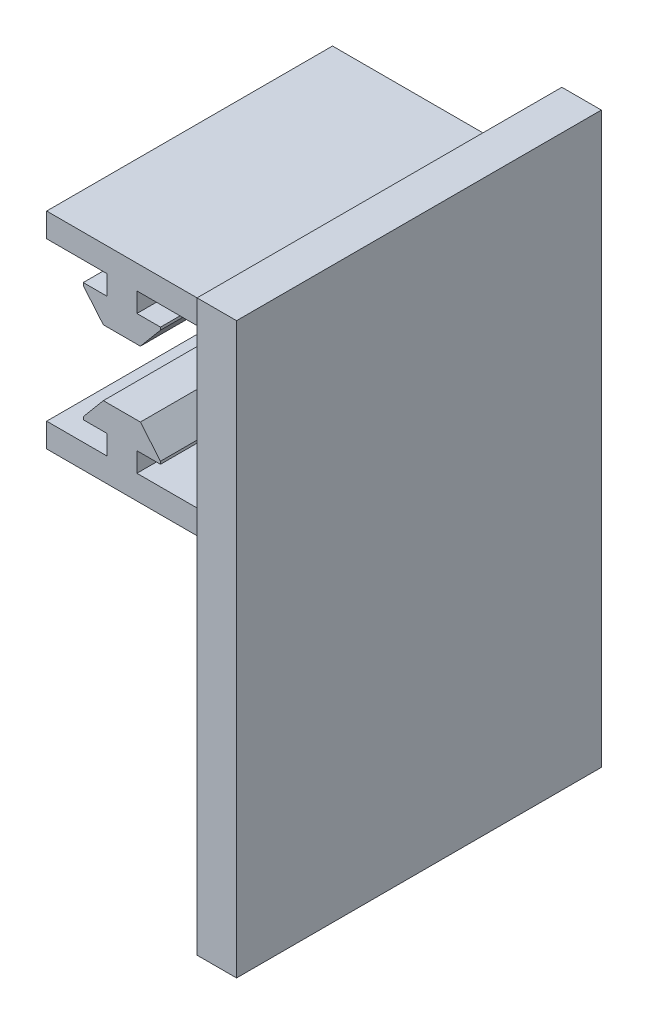
ISO-10303-21;
HEADER;
FILE_DESCRIPTION(('STEP AP214'),'2;1');
FILE_NAME('part.step','',(''),(''),'','','');
FILE_SCHEMA(('AUTOMOTIVE_DESIGN { 1 0 10303 214 1 1 1 1 }'));
ENDSEC;
DATA;
#1=APPLICATION_CONTEXT('core data for automotive mechanical design processes');
#2=APPLICATION_PROTOCOL_DEFINITION('international standard','automotive_design',2000,#1);
#3=PRODUCT_CONTEXT('',#1,'mechanical');
#4=PRODUCT('Part','Part','',(#3));
#5=PRODUCT_RELATED_PRODUCT_CATEGORY('part','',(#4));
#6=PRODUCT_DEFINITION_FORMATION('','',#4);
#7=PRODUCT_DEFINITION_CONTEXT('part definition',#1,'design');
#8=PRODUCT_DEFINITION('design','',#6,#7);
#9=PRODUCT_DEFINITION_SHAPE('','',#8);
#10=(LENGTH_UNIT() NAMED_UNIT(*) SI_UNIT(.MILLI.,.METRE.));
#11=(NAMED_UNIT(*) PLANE_ANGLE_UNIT() SI_UNIT($,.RADIAN.));
#12=(NAMED_UNIT(*) SI_UNIT($,.STERADIAN.) SOLID_ANGLE_UNIT());
#13=UNCERTAINTY_MEASURE_WITH_UNIT(LENGTH_MEASURE(1.E-05),#10,'distance_accuracy_value','');
#14=(GEOMETRIC_REPRESENTATION_CONTEXT(3) GLOBAL_UNCERTAINTY_ASSIGNED_CONTEXT((#13)) GLOBAL_UNIT_ASSIGNED_CONTEXT((#10,
#11,#12)) REPRESENTATION_CONTEXT('',''));
#15=CARTESIAN_POINT('',(0.,0.,0.));
#16=DIRECTION('',(0.,0.,1.));
#17=DIRECTION('',(1.,0.,0.));
#18=AXIS2_PLACEMENT_3D('',#15,#16,#17);
#19=CARTESIAN_POINT('',(-19.05,-43.302,457.2));
#20=DIRECTION('',(-1.,0.,0.));
#21=DIRECTION('',(0.,0.,1.));
#22=AXIS2_PLACEMENT_3D('',#19,#20,#21);
#23=PLANE('',#22);
#24=DIRECTION('',(0.,0.,-1.));
#25=VECTOR('',#24,1.);
#26=CARTESIAN_POINT('',(-19.05,-43.302,457.2));
#27=LINE('',#26,#25);
#28=CARTESIAN_POINT('',(-19.05,-43.302,415.2));
#29=VERTEX_POINT('',#28);
#30=CARTESIAN_POINT('',(-19.05,-43.302,342.8));
#31=VERTEX_POINT('',#30);
#32=EDGE_CURVE('E417',#29,#31,#27,.T.);
#33=ORIENTED_EDGE('',*,*,#32,.F.);
#34=DIRECTION('',(0.,-1.,0.));
#35=VECTOR('',#34,1.);
#36=CARTESIAN_POINT('',(-19.05,8.89,415.2));
#37=LINE('',#36,#35);
#38=CARTESIAN_POINT('',(-19.05,-37.206,415.2));
#39=VERTEX_POINT('',#38);
#40=EDGE_CURVE('E294',#39,#29,#37,.T.);
#41=ORIENTED_EDGE('',*,*,#40,.F.);
#42=DIRECTION('',(0.,0.,-1.));
#43=VECTOR('',#42,1.);
#44=CARTESIAN_POINT('',(-19.05,-37.206,457.2));
#45=LINE('',#44,#43);
#46=CARTESIAN_POINT('',(-19.05,-37.206,342.8));
#47=VERTEX_POINT('',#46);
#48=EDGE_CURVE('E395',#39,#47,#45,.T.);
#49=ORIENTED_EDGE('',*,*,#48,.T.);
#50=DIRECTION('',(0.,-1.,0.));
#51=VECTOR('',#50,1.);
#52=CARTESIAN_POINT('',(-19.05,-43.302,342.8));
#53=LINE('',#52,#51);
#54=EDGE_CURVE('E392',#47,#31,#53,.T.);
#55=ORIENTED_EDGE('',*,*,#54,.T.);
#56=EDGE_LOOP('',(#33,#41,#49,#55));
#57=FACE_BOUND('',#56,.T.);
#58=ADVANCED_FACE('F36',(#57),#23,.T.);
#59=CARTESIAN_POINT('',(-19.05,-43.302,457.2));
#60=DIRECTION('',(0.,-1.,0.));
#61=DIRECTION('',(0.,0.,-1.));
#62=AXIS2_PLACEMENT_3D('',#59,#60,#61);
#63=PLANE('',#62);
#64=DIRECTION('',(0.,0.,-1.));
#65=VECTOR('',#64,1.);
#66=CARTESIAN_POINT('',(29.05,-43.302,342.8));
#67=LINE('',#66,#65);
#68=CARTESIAN_POINT('',(29.05,-43.302,415.2));
#69=VERTEX_POINT('',#68);
#70=CARTESIAN_POINT('',(29.05,-43.302,342.8));
#71=VERTEX_POINT('',#70);
#72=EDGE_CURVE('E357',#69,#71,#67,.T.);
#73=ORIENTED_EDGE('',*,*,#72,.F.);
#74=DIRECTION('',(1.,0.,0.));
#75=VECTOR('',#74,1.);
#76=CARTESIAN_POINT('',(-19.05,-43.302,415.2));
#77=LINE('',#76,#75);
#78=EDGE_CURVE('E58',#29,#69,#77,.T.);
#79=ORIENTED_EDGE('',*,*,#78,.F.);
#80=ORIENTED_EDGE('',*,*,#32,.T.);
#81=DIRECTION('',(1.,0.,0.));
#82=VECTOR('',#81,1.);
#83=CARTESIAN_POINT('',(-19.05,-43.302,342.8));
#84=LINE('',#83,#82);
#85=EDGE_CURVE('E390',#31,#71,#84,.T.);
#86=ORIENTED_EDGE('',*,*,#85,.T.);
#87=EDGE_LOOP('',(#73,#79,#80,#86));
#88=FACE_BOUND('',#87,.T.);
#89=ADVANCED_FACE('F609',(#88),#63,.T.);
#90=CARTESIAN_POINT('',(19.05,-37.206,457.2));
#91=DIRECTION('',(0.,1.,0.));
#92=DIRECTION('',(0.,0.,1.));
#93=AXIS2_PLACEMENT_3D('',#90,#91,#92);
#94=PLANE('',#93);
#95=DIRECTION('',(0.,0.,-1.));
#96=VECTOR('',#95,1.);
#97=CARTESIAN_POINT('',(3.81,-37.206,457.2));
#98=LINE('',#97,#96);
#99=CARTESIAN_POINT('',(3.81,-37.206,415.2));
#100=VERTEX_POINT('',#99);
#101=CARTESIAN_POINT('',(3.81,-37.206,342.8));
#102=VERTEX_POINT('',#101);
#103=EDGE_CURVE('E415',#100,#102,#98,.T.);
#104=ORIENTED_EDGE('',*,*,#103,.F.);
#105=DIRECTION('',(1.,0.,0.));
#106=VECTOR('',#105,1.);
#107=CARTESIAN_POINT('',(19.05,-37.206,415.2));
#108=LINE('',#107,#106);
#109=CARTESIAN_POINT('',(19.95,-37.206,415.2));
#110=VERTEX_POINT('',#109);
#111=EDGE_CURVE('E325',#100,#110,#108,.T.);
#112=ORIENTED_EDGE('',*,*,#111,.T.);
#113=DIRECTION('',(0.,0.,-1.));
#114=VECTOR('',#113,1.);
#115=CARTESIAN_POINT('',(19.95,-37.206,432.8));
#116=LINE('',#115,#114);
#117=CARTESIAN_POINT('',(19.95,-37.206,342.8));
#118=VERTEX_POINT('',#117);
#119=EDGE_CURVE('E291',#110,#118,#116,.T.);
#120=ORIENTED_EDGE('',*,*,#119,.T.);
#121=DIRECTION('',(-1.,0.,0.));
#122=VECTOR('',#121,1.);
#123=CARTESIAN_POINT('',(19.05,-37.206,342.8));
#124=LINE('',#123,#122);
#125=EDGE_CURVE('E387',#118,#102,#124,.T.);
#126=ORIENTED_EDGE('',*,*,#125,.T.);
#127=EDGE_LOOP('',(#104,#112,#120,#126));
#128=FACE_BOUND('',#127,.T.);
#129=ADVANCED_FACE('F534',(#128),#94,.T.);
#130=CARTESIAN_POINT('',(3.81,-37.206,457.2));
#131=DIRECTION('',(1.,0.,0.));
#132=DIRECTION('',(0.,0.,-1.));
#133=AXIS2_PLACEMENT_3D('',#130,#131,#132);
#134=PLANE('',#133);
#135=DIRECTION('',(0.,0.,-1.));
#136=VECTOR('',#135,1.);
#137=CARTESIAN_POINT('',(3.81,-32.253,457.2));
#138=LINE('',#137,#136);
#139=CARTESIAN_POINT('',(3.81,-32.253,415.2));
#140=VERTEX_POINT('',#139);
#141=CARTESIAN_POINT('',(3.81,-32.253,342.8));
#142=VERTEX_POINT('',#141);
#143=EDGE_CURVE('E413',#140,#142,#138,.T.);
#144=ORIENTED_EDGE('',*,*,#143,.F.);
#145=DIRECTION('',(0.,-1.,0.));
#146=VECTOR('',#145,1.);
#147=CARTESIAN_POINT('',(3.81,-37.206,415.2));
#148=LINE('',#147,#146);
#149=EDGE_CURVE('E327',#140,#100,#148,.T.);
#150=ORIENTED_EDGE('',*,*,#149,.T.);
#151=ORIENTED_EDGE('',*,*,#103,.T.);
#152=DIRECTION('',(0.,1.,0.));
#153=VECTOR('',#152,1.);
#154=CARTESIAN_POINT('',(3.81,-37.206,342.8));
#155=LINE('',#154,#153);
#156=EDGE_CURVE('E384',#102,#142,#155,.T.);
#157=ORIENTED_EDGE('',*,*,#156,.T.);
#158=EDGE_LOOP('',(#144,#150,#151,#157));
#159=FACE_BOUND('',#158,.T.);
#160=ADVANCED_FACE('F531',(#159),#134,.T.);
#161=CARTESIAN_POINT('',(3.81,-32.253,457.2));
#162=DIRECTION('',(0.,-1.,0.));
#163=DIRECTION('',(1.,0.,0.));
#164=AXIS2_PLACEMENT_3D('',#161,#162,#163);
#165=PLANE('',#164);
#166=DIRECTION('',(0.,0.,-1.));
#167=VECTOR('',#166,1.);
#168=CARTESIAN_POINT('',(9.779,-32.253,457.2));
#169=LINE('',#168,#167);
#170=CARTESIAN_POINT('',(9.779,-32.253,415.2));
#171=VERTEX_POINT('',#170);
#172=CARTESIAN_POINT('',(9.779,-32.253,342.8));
#173=VERTEX_POINT('',#172);
#174=EDGE_CURVE('E411',#171,#173,#169,.T.);
#175=ORIENTED_EDGE('',*,*,#174,.F.);
#176=DIRECTION('',(-1.,0.,0.));
#177=VECTOR('',#176,1.);
#178=CARTESIAN_POINT('',(3.81,-32.253,415.2));
#179=LINE('',#178,#177);
#180=EDGE_CURVE('E330',#171,#140,#179,.T.);
#181=ORIENTED_EDGE('',*,*,#180,.T.);
#182=ORIENTED_EDGE('',*,*,#143,.T.);
#183=DIRECTION('',(1.,0.,0.));
#184=VECTOR('',#183,1.);
#185=CARTESIAN_POINT('',(3.81,-32.253,342.8));
#186=LINE('',#185,#184);
#187=EDGE_CURVE('E381',#142,#173,#186,.T.);
#188=ORIENTED_EDGE('',*,*,#187,.T.);
#189=EDGE_LOOP('',(#175,#181,#182,#188));
#190=FACE_BOUND('',#189,.T.);
#191=ADVANCED_FACE('F527',(#190),#165,.T.);
#192=CARTESIAN_POINT('',(9.779,-31.5799,457.2));
#193=DIRECTION('',(1.,0.,0.));
#194=DIRECTION('',(0.,0.,-1.));
#195=AXIS2_PLACEMENT_3D('',#192,#193,#194);
#196=PLANE('',#195);
#197=DIRECTION('',(0.,0.,-1.));
#198=VECTOR('',#197,1.);
#199=CARTESIAN_POINT('',(9.779,-31.5799,457.2));
#200=LINE('',#199,#198);
#201=CARTESIAN_POINT('',(9.779,-31.5799,415.2));
#202=VERTEX_POINT('',#201);
#203=CARTESIAN_POINT('',(9.779,-31.5799,342.8));
#204=VERTEX_POINT('',#203);
#205=EDGE_CURVE('E409',#202,#204,#200,.T.);
#206=ORIENTED_EDGE('',*,*,#205,.F.);
#207=DIRECTION('',(0.,-1.,0.));
#208=VECTOR('',#207,1.);
#209=CARTESIAN_POINT('',(9.779,-31.5799,415.2));
#210=LINE('',#209,#208);
#211=EDGE_CURVE('E333',#202,#171,#210,.T.);
#212=ORIENTED_EDGE('',*,*,#211,.T.);
#213=ORIENTED_EDGE('',*,*,#174,.T.);
#214=DIRECTION('',(0.,1.,0.));
#215=VECTOR('',#214,1.);
#216=CARTESIAN_POINT('',(9.779,-31.5799,342.8));
#217=LINE('',#216,#215);
#218=EDGE_CURVE('E378',#173,#204,#217,.T.);
#219=ORIENTED_EDGE('',*,*,#218,.T.);
#220=EDGE_LOOP('',(#206,#212,#213,#219));
#221=FACE_BOUND('',#220,.T.);
#222=ADVANCED_FACE('F524',(#221),#196,.T.);
#223=CARTESIAN_POINT('',(4.69581834429117,-25.522,457.2));
#224=DIRECTION('',(0.766044443118979,0.642787609686538,0.));
#225=DIRECTION('',(-0.642787609686538,0.766044443118979,0.));
#226=AXIS2_PLACEMENT_3D('',#223,#224,#225);
#227=PLANE('',#226);
#228=DIRECTION('',(0.,0.,-1.));
#229=VECTOR('',#228,1.);
#230=CARTESIAN_POINT('',(4.69581834429117,-25.522,457.2));
#231=LINE('',#230,#229);
#232=CARTESIAN_POINT('',(4.69581834429117,-25.522,415.2));
#233=VERTEX_POINT('',#232);
#234=CARTESIAN_POINT('',(4.69581834429117,-25.522,342.8));
#235=VERTEX_POINT('',#234);
#236=EDGE_CURVE('E407',#233,#235,#231,.T.);
#237=ORIENTED_EDGE('',*,*,#236,.F.);
#238=DIRECTION('',(0.642787609686538,-0.766044443118979,0.));
#239=VECTOR('',#238,1.);
#240=CARTESIAN_POINT('',(4.69581834429117,-25.522,415.2));
#241=LINE('',#240,#239);
#242=EDGE_CURVE('E336',#233,#202,#241,.T.);
#243=ORIENTED_EDGE('',*,*,#242,.T.);
#244=ORIENTED_EDGE('',*,*,#205,.T.);
#245=DIRECTION('',(-0.642787609686538,0.766044443118979,0.));
#246=VECTOR('',#245,1.);
#247=CARTESIAN_POINT('',(4.69581834429117,-25.522,342.8));
#248=LINE('',#247,#246);
#249=EDGE_CURVE('E375',#204,#235,#248,.T.);
#250=ORIENTED_EDGE('',*,*,#249,.T.);
#251=EDGE_LOOP('',(#237,#243,#244,#250));
#252=FACE_BOUND('',#251,.T.);
#253=ADVANCED_FACE('F519',(#252),#227,.T.);
#254=CARTESIAN_POINT('',(-4.69581834429117,-25.522,457.2));
#255=DIRECTION('',(0.,1.,0.));
#256=DIRECTION('',(0.,0.,1.));
#257=AXIS2_PLACEMENT_3D('',#254,#255,#256);
#258=PLANE('',#257);
#259=DIRECTION('',(0.,0.,-1.));
#260=VECTOR('',#259,1.);
#261=CARTESIAN_POINT('',(-4.69581834429117,-25.522,457.2));
#262=LINE('',#261,#260);
#263=CARTESIAN_POINT('',(-4.69581834429117,-25.522,415.2));
#264=VERTEX_POINT('',#263);
#265=CARTESIAN_POINT('',(-4.69581834429117,-25.522,342.8));
#266=VERTEX_POINT('',#265);
#267=EDGE_CURVE('E405',#264,#266,#262,.T.);
#268=ORIENTED_EDGE('',*,*,#267,.F.);
#269=DIRECTION('',(1.,0.,0.));
#270=VECTOR('',#269,1.);
#271=CARTESIAN_POINT('',(-4.69581834429117,-25.522,415.2));
#272=LINE('',#271,#270);
#273=EDGE_CURVE('E339',#264,#233,#272,.T.);
#274=ORIENTED_EDGE('',*,*,#273,.T.);
#275=ORIENTED_EDGE('',*,*,#236,.T.);
#276=DIRECTION('',(-1.,0.,0.));
#277=VECTOR('',#276,1.);
#278=CARTESIAN_POINT('',(-4.69581834429117,-25.522,342.8));
#279=LINE('',#278,#277);
#280=EDGE_CURVE('E372',#235,#266,#279,.T.);
#281=ORIENTED_EDGE('',*,*,#280,.T.);
#282=EDGE_LOOP('',(#268,#274,#275,#281));
#283=FACE_BOUND('',#282,.T.);
#284=ADVANCED_FACE('F516',(#283),#258,.T.);
#285=CARTESIAN_POINT('',(-9.779,-31.5799,457.2));
#286=DIRECTION('',(-0.766044443118979,0.642787609686538,0.));
#287=DIRECTION('',(-0.642787609686538,-0.766044443118979,0.));
#288=AXIS2_PLACEMENT_3D('',#285,#286,#287);
#289=PLANE('',#288);
#290=DIRECTION('',(0.,0.,-1.));
#291=VECTOR('',#290,1.);
#292=CARTESIAN_POINT('',(-9.779,-31.5799,457.2));
#293=LINE('',#292,#291);
#294=CARTESIAN_POINT('',(-9.779,-31.5799,415.2));
#295=VERTEX_POINT('',#294);
#296=CARTESIAN_POINT('',(-9.779,-31.5799,342.8));
#297=VERTEX_POINT('',#296);
#298=EDGE_CURVE('E403',#295,#297,#293,.T.);
#299=ORIENTED_EDGE('',*,*,#298,.F.);
#300=DIRECTION('',(0.642787609686538,0.766044443118979,0.));
#301=VECTOR('',#300,1.);
#302=CARTESIAN_POINT('',(-9.779,-31.5799,415.2));
#303=LINE('',#302,#301);
#304=EDGE_CURVE('E342',#295,#264,#303,.T.);
#305=ORIENTED_EDGE('',*,*,#304,.T.);
#306=ORIENTED_EDGE('',*,*,#267,.T.);
#307=DIRECTION('',(-0.642787609686538,-0.766044443118979,0.));
#308=VECTOR('',#307,1.);
#309=CARTESIAN_POINT('',(-9.779,-31.5799,342.8));
#310=LINE('',#309,#308);
#311=EDGE_CURVE('E369',#266,#297,#310,.T.);
#312=ORIENTED_EDGE('',*,*,#311,.T.);
#313=EDGE_LOOP('',(#299,#305,#306,#312));
#314=FACE_BOUND('',#313,.T.);
#315=ADVANCED_FACE('F511',(#314),#289,.T.);
#316=CARTESIAN_POINT('',(-9.779,-32.253,457.2));
#317=DIRECTION('',(-1.,0.,0.));
#318=DIRECTION('',(0.,0.,1.));
#319=AXIS2_PLACEMENT_3D('',#316,#317,#318);
#320=PLANE('',#319);
#321=DIRECTION('',(0.,0.,-1.));
#322=VECTOR('',#321,1.);
#323=CARTESIAN_POINT('',(-9.779,-32.253,457.2));
#324=LINE('',#323,#322);
#325=CARTESIAN_POINT('',(-9.779,-32.253,415.2));
#326=VERTEX_POINT('',#325);
#327=CARTESIAN_POINT('',(-9.779,-32.253,342.8));
#328=VERTEX_POINT('',#327);
#329=EDGE_CURVE('E401',#326,#328,#324,.T.);
#330=ORIENTED_EDGE('',*,*,#329,.F.);
#331=DIRECTION('',(0.,1.,0.));
#332=VECTOR('',#331,1.);
#333=CARTESIAN_POINT('',(-9.779,-32.253,415.2));
#334=LINE('',#333,#332);
#335=EDGE_CURVE('E345',#326,#295,#334,.T.);
#336=ORIENTED_EDGE('',*,*,#335,.T.);
#337=ORIENTED_EDGE('',*,*,#298,.T.);
#338=DIRECTION('',(0.,-1.,0.));
#339=VECTOR('',#338,1.);
#340=CARTESIAN_POINT('',(-9.779,-32.253,342.8));
#341=LINE('',#340,#339);
#342=EDGE_CURVE('E366',#297,#328,#341,.T.);
#343=ORIENTED_EDGE('',*,*,#342,.T.);
#344=EDGE_LOOP('',(#330,#336,#337,#343));
#345=FACE_BOUND('',#344,.T.);
#346=ADVANCED_FACE('F508',(#345),#320,.T.);
#347=CARTESIAN_POINT('',(-3.81,-32.253,457.2));
#348=DIRECTION('',(0.,-1.,0.));
#349=DIRECTION('',(1.,0.,0.));
#350=AXIS2_PLACEMENT_3D('',#347,#348,#349);
#351=PLANE('',#350);
#352=DIRECTION('',(0.,0.,-1.));
#353=VECTOR('',#352,1.);
#354=CARTESIAN_POINT('',(-3.81,-32.253,457.2));
#355=LINE('',#354,#353);
#356=CARTESIAN_POINT('',(-3.81,-32.253,415.2));
#357=VERTEX_POINT('',#356);
#358=CARTESIAN_POINT('',(-3.81,-32.253,342.8));
#359=VERTEX_POINT('',#358);
#360=EDGE_CURVE('E399',#357,#359,#355,.T.);
#361=ORIENTED_EDGE('',*,*,#360,.F.);
#362=DIRECTION('',(-1.,0.,0.));
#363=VECTOR('',#362,1.);
#364=CARTESIAN_POINT('',(-3.81,-32.253,415.2));
#365=LINE('',#364,#363);
#366=EDGE_CURVE('E348',#357,#326,#365,.T.);
#367=ORIENTED_EDGE('',*,*,#366,.T.);
#368=ORIENTED_EDGE('',*,*,#329,.T.);
#369=DIRECTION('',(1.,0.,0.));
#370=VECTOR('',#369,1.);
#371=CARTESIAN_POINT('',(-3.81,-32.253,342.8));
#372=LINE('',#371,#370);
#373=EDGE_CURVE('E363',#328,#359,#372,.T.);
#374=ORIENTED_EDGE('',*,*,#373,.T.);
#375=EDGE_LOOP('',(#361,#367,#368,#374));
#376=FACE_BOUND('',#375,.T.);
#377=ADVANCED_FACE('F503',(#376),#351,.T.);
#378=CARTESIAN_POINT('',(-3.81,-37.206,457.2));
#379=DIRECTION('',(-1.,0.,0.));
#380=DIRECTION('',(0.,0.,1.));
#381=AXIS2_PLACEMENT_3D('',#378,#379,#380);
#382=PLANE('',#381);
#383=DIRECTION('',(0.,0.,-1.));
#384=VECTOR('',#383,1.);
#385=CARTESIAN_POINT('',(-3.81,-37.206,457.2));
#386=LINE('',#385,#384);
#387=CARTESIAN_POINT('',(-3.81,-37.206,415.2));
#388=VERTEX_POINT('',#387);
#389=CARTESIAN_POINT('',(-3.81,-37.206,342.8));
#390=VERTEX_POINT('',#389);
#391=EDGE_CURVE('E397',#388,#390,#386,.T.);
#392=ORIENTED_EDGE('',*,*,#391,.F.);
#393=DIRECTION('',(0.,1.,0.));
#394=VECTOR('',#393,1.);
#395=CARTESIAN_POINT('',(-3.81,-37.206,415.2));
#396=LINE('',#395,#394);
#397=EDGE_CURVE('E351',#388,#357,#396,.T.);
#398=ORIENTED_EDGE('',*,*,#397,.T.);
#399=ORIENTED_EDGE('',*,*,#360,.T.);
#400=DIRECTION('',(0.,-1.,0.));
#401=VECTOR('',#400,1.);
#402=CARTESIAN_POINT('',(-3.81,-37.206,342.8));
#403=LINE('',#402,#401);
#404=EDGE_CURVE('E360',#359,#390,#403,.T.);
#405=ORIENTED_EDGE('',*,*,#404,.T.);
#406=EDGE_LOOP('',(#392,#398,#399,#405));
#407=FACE_BOUND('',#406,.T.);
#408=ADVANCED_FACE('F500',(#407),#382,.T.);
#409=CARTESIAN_POINT('',(-19.05,-37.206,457.2));
#410=DIRECTION('',(0.,1.,0.));
#411=DIRECTION('',(0.,0.,1.));
#412=AXIS2_PLACEMENT_3D('',#409,#410,#411);
#413=PLANE('',#412);
#414=ORIENTED_EDGE('',*,*,#48,.F.);
#415=DIRECTION('',(1.,0.,0.));
#416=VECTOR('',#415,1.);
#417=CARTESIAN_POINT('',(-19.05,-37.206,415.2));
#418=LINE('',#417,#416);
#419=EDGE_CURVE('E354',#39,#388,#418,.T.);
#420=ORIENTED_EDGE('',*,*,#419,.T.);
#421=ORIENTED_EDGE('',*,*,#391,.T.);
#422=DIRECTION('',(-1.,0.,0.));
#423=VECTOR('',#422,1.);
#424=CARTESIAN_POINT('',(-19.05,-37.206,342.8));
#425=LINE('',#424,#423);
#426=EDGE_CURVE('E44',#390,#47,#425,.T.);
#427=ORIENTED_EDGE('',*,*,#426,.T.);
#428=EDGE_LOOP('',(#414,#420,#421,#427));
#429=FACE_BOUND('',#428,.T.);
#430=ADVANCED_FACE('F491',(#429),#413,.T.);
#431=CARTESIAN_POINT('',(-19.05,8.89,457.2));
#432=DIRECTION('',(1.,0.,0.));
#433=DIRECTION('',(0.,0.,-1.));
#434=AXIS2_PLACEMENT_3D('',#431,#432,#433);
#435=PLANE('',#434);
#436=CARTESIAN_POINT('',(-19.05,8.89,415.2));
#437=VERTEX_POINT('',#436);
#438=CARTESIAN_POINT('',(-19.05,2.794,415.2));
#439=VERTEX_POINT('',#438);
#440=EDGE_CURVE('E297',#437,#439,#37,.T.);
#441=ORIENTED_EDGE('',*,*,#440,.F.);
#442=DIRECTION('',(0.,0.,-1.));
#443=VECTOR('',#442,1.);
#444=CARTESIAN_POINT('',(-19.05,8.89,457.2));
#445=LINE('',#444,#443);
#446=CARTESIAN_POINT('',(-19.05,8.89,342.8));
#447=VERTEX_POINT('',#446);
#448=EDGE_CURVE('E461',#437,#447,#445,.T.);
#449=ORIENTED_EDGE('',*,*,#448,.T.);
#450=DIRECTION('',(0.,1.,0.));
#451=VECTOR('',#450,1.);
#452=CARTESIAN_POINT('',(-19.05,8.89,342.8));
#453=LINE('',#452,#451);
#454=CARTESIAN_POINT('',(-19.05,2.794,342.8));
#455=VERTEX_POINT('',#454);
#456=EDGE_CURVE('E458',#455,#447,#453,.T.);
#457=ORIENTED_EDGE('',*,*,#456,.F.);
#458=DIRECTION('',(0.,0.,-1.));
#459=VECTOR('',#458,1.);
#460=CARTESIAN_POINT('',(-19.05,2.794,457.2));
#461=LINE('',#460,#459);
#462=EDGE_CURVE('E483',#439,#455,#461,.T.);
#463=ORIENTED_EDGE('',*,*,#462,.F.);
#464=EDGE_LOOP('',(#441,#449,#457,#463));
#465=FACE_BOUND('',#464,.T.);
#466=ADVANCED_FACE('F38',(#465),#435,.F.);
#467=CARTESIAN_POINT('',(-19.05,2.794,457.2));
#468=DIRECTION('',(0.,1.,0.));
#469=DIRECTION('',(0.,0.,1.));
#470=AXIS2_PLACEMENT_3D('',#467,#468,#469);
#471=PLANE('',#470);
#472=DIRECTION('',(1.,0.,0.));
#473=VECTOR('',#472,1.);
#474=CARTESIAN_POINT('',(-19.05,2.794,415.2));
#475=LINE('',#474,#473);
#476=CARTESIAN_POINT('',(-3.81,2.794,415.2));
#477=VERTEX_POINT('',#476);
#478=EDGE_CURVE('E323',#439,#477,#475,.T.);
#479=ORIENTED_EDGE('',*,*,#478,.F.);
#480=ORIENTED_EDGE('',*,*,#462,.T.);
#481=DIRECTION('',(-1.,0.,0.));
#482=VECTOR('',#481,1.);
#483=CARTESIAN_POINT('',(-19.05,2.794,342.8));
#484=LINE('',#483,#482);
#485=CARTESIAN_POINT('',(-3.81,2.794,342.8));
#486=VERTEX_POINT('',#485);
#487=EDGE_CURVE('E455',#486,#455,#484,.T.);
#488=ORIENTED_EDGE('',*,*,#487,.F.);
#489=DIRECTION('',(0.,0.,-1.));
#490=VECTOR('',#489,1.);
#491=CARTESIAN_POINT('',(-3.81,2.794,457.2));
#492=LINE('',#491,#490);
#493=EDGE_CURVE('E481',#477,#486,#492,.T.);
#494=ORIENTED_EDGE('',*,*,#493,.F.);
#495=EDGE_LOOP('',(#479,#480,#488,#494));
#496=FACE_BOUND('',#495,.T.);
#497=ADVANCED_FACE('F591',(#496),#471,.F.);
#498=CARTESIAN_POINT('',(-3.81,2.794,457.2));
#499=DIRECTION('',(1.,0.,0.));
#500=DIRECTION('',(0.,0.,-1.));
#501=AXIS2_PLACEMENT_3D('',#498,#499,#500);
#502=PLANE('',#501);
#503=DIRECTION('',(0.,-1.,0.));
#504=VECTOR('',#503,1.);
#505=CARTESIAN_POINT('',(-3.81,2.794,415.2));
#506=LINE('',#505,#504);
#507=CARTESIAN_POINT('',(-3.81,-2.159,415.2));
#508=VERTEX_POINT('',#507);
#509=EDGE_CURVE('E321',#477,#508,#506,.T.);
#510=ORIENTED_EDGE('',*,*,#509,.F.);
#511=ORIENTED_EDGE('',*,*,#493,.T.);
#512=DIRECTION('',(0.,1.,0.));
#513=VECTOR('',#512,1.);
#514=CARTESIAN_POINT('',(-3.81,2.794,342.8));
#515=LINE('',#514,#513);
#516=CARTESIAN_POINT('',(-3.81,-2.159,342.8));
#517=VERTEX_POINT('',#516);
#518=EDGE_CURVE('E452',#517,#486,#515,.T.);
#519=ORIENTED_EDGE('',*,*,#518,.F.);
#520=DIRECTION('',(0.,0.,-1.));
#521=VECTOR('',#520,1.);
#522=CARTESIAN_POINT('',(-3.81,-2.159,457.2));
#523=LINE('',#522,#521);
#524=EDGE_CURVE('E479',#508,#517,#523,.T.);
#525=ORIENTED_EDGE('',*,*,#524,.F.);
#526=EDGE_LOOP('',(#510,#511,#519,#525));
#527=FACE_BOUND('',#526,.T.);
#528=ADVANCED_FACE('F585',(#527),#502,.F.);
#529=CARTESIAN_POINT('',(-3.81,-2.159,457.2));
#530=DIRECTION('',(0.,-1.,0.));
#531=DIRECTION('',(1.,0.,0.));
#532=AXIS2_PLACEMENT_3D('',#529,#530,#531);
#533=PLANE('',#532);
#534=DIRECTION('',(-1.,0.,0.));
#535=VECTOR('',#534,1.);
#536=CARTESIAN_POINT('',(-3.81,-2.159,415.2));
#537=LINE('',#536,#535);
#538=CARTESIAN_POINT('',(-9.779,-2.159,415.2));
#539=VERTEX_POINT('',#538);
#540=EDGE_CURVE('E319',#508,#539,#537,.T.);
#541=ORIENTED_EDGE('',*,*,#540,.F.);
#542=ORIENTED_EDGE('',*,*,#524,.T.);
#543=DIRECTION('',(1.,0.,0.));
#544=VECTOR('',#543,1.);
#545=CARTESIAN_POINT('',(-3.81,-2.159,342.8));
#546=LINE('',#545,#544);
#547=CARTESIAN_POINT('',(-9.779,-2.159,342.8));
#548=VERTEX_POINT('',#547);
#549=EDGE_CURVE('E449',#548,#517,#546,.T.);
#550=ORIENTED_EDGE('',*,*,#549,.F.);
#551=DIRECTION('',(0.,0.,-1.));
#552=VECTOR('',#551,1.);
#553=CARTESIAN_POINT('',(-9.779,-2.159,457.2));
#554=LINE('',#553,#552);
#555=EDGE_CURVE('E477',#539,#548,#554,.T.);
#556=ORIENTED_EDGE('',*,*,#555,.F.);
#557=EDGE_LOOP('',(#541,#542,#550,#556));
#558=FACE_BOUND('',#557,.T.);
#559=ADVANCED_FACE('F581',(#558),#533,.F.);
#560=CARTESIAN_POINT('',(-9.779,-2.159,457.2));
#561=DIRECTION('',(1.,0.,0.));
#562=DIRECTION('',(0.,0.,-1.));
#563=AXIS2_PLACEMENT_3D('',#560,#561,#562);
#564=PLANE('',#563);
#565=DIRECTION('',(0.,-1.,0.));
#566=VECTOR('',#565,1.);
#567=CARTESIAN_POINT('',(-9.779,-2.159,415.2));
#568=LINE('',#567,#566);
#569=CARTESIAN_POINT('',(-9.779,-2.8321,415.2));
#570=VERTEX_POINT('',#569);
#571=EDGE_CURVE('E317',#539,#570,#568,.T.);
#572=ORIENTED_EDGE('',*,*,#571,.F.);
#573=ORIENTED_EDGE('',*,*,#555,.T.);
#574=DIRECTION('',(0.,1.,0.));
#575=VECTOR('',#574,1.);
#576=CARTESIAN_POINT('',(-9.779,-2.159,342.8));
#577=LINE('',#576,#575);
#578=CARTESIAN_POINT('',(-9.779,-2.8321,342.8));
#579=VERTEX_POINT('',#578);
#580=EDGE_CURVE('E446',#579,#548,#577,.T.);
#581=ORIENTED_EDGE('',*,*,#580,.F.);
#582=DIRECTION('',(0.,0.,-1.));
#583=VECTOR('',#582,1.);
#584=CARTESIAN_POINT('',(-9.779,-2.8321,457.2));
#585=LINE('',#584,#583);
#586=EDGE_CURVE('E475',#570,#579,#585,.T.);
#587=ORIENTED_EDGE('',*,*,#586,.F.);
#588=EDGE_LOOP('',(#572,#573,#581,#587));
#589=FACE_BOUND('',#588,.T.);
#590=ADVANCED_FACE('F575',(#589),#564,.F.);
#591=CARTESIAN_POINT('',(-9.779,-2.8321,457.2));
#592=DIRECTION('',(0.766044443118979,0.642787609686538,0.));
#593=DIRECTION('',(-0.642787609686538,0.766044443118979,0.));
#594=AXIS2_PLACEMENT_3D('',#591,#592,#593);
#595=PLANE('',#594);
#596=DIRECTION('',(0.642787609686538,-0.766044443118979,0.));
#597=VECTOR('',#596,1.);
#598=CARTESIAN_POINT('',(-9.779,-2.8321,415.2));
#599=LINE('',#598,#597);
#600=CARTESIAN_POINT('',(-4.69581834429117,-8.89,415.2));
#601=VERTEX_POINT('',#600);
#602=EDGE_CURVE('E315',#570,#601,#599,.T.);
#603=ORIENTED_EDGE('',*,*,#602,.F.);
#604=ORIENTED_EDGE('',*,*,#586,.T.);
#605=DIRECTION('',(-0.642787609686538,0.766044443118979,0.));
#606=VECTOR('',#605,1.);
#607=CARTESIAN_POINT('',(-9.779,-2.8321,342.8));
#608=LINE('',#607,#606);
#609=CARTESIAN_POINT('',(-4.69581834429117,-8.89,342.8));
#610=VERTEX_POINT('',#609);
#611=EDGE_CURVE('E443',#610,#579,#608,.T.);
#612=ORIENTED_EDGE('',*,*,#611,.F.);
#613=DIRECTION('',(0.,0.,-1.));
#614=VECTOR('',#613,1.);
#615=CARTESIAN_POINT('',(-4.69581834429117,-8.89,457.2));
#616=LINE('',#615,#614);
#617=EDGE_CURVE('E473',#601,#610,#616,.T.);
#618=ORIENTED_EDGE('',*,*,#617,.F.);
#619=EDGE_LOOP('',(#603,#604,#612,#618));
#620=FACE_BOUND('',#619,.T.);
#621=ADVANCED_FACE('F571',(#620),#595,.F.);
#622=CARTESIAN_POINT('',(-4.69581834429117,-8.89,457.2));
#623=DIRECTION('',(0.,1.,0.));
#624=DIRECTION('',(0.,0.,1.));
#625=AXIS2_PLACEMENT_3D('',#622,#623,#624);
#626=PLANE('',#625);
#627=DIRECTION('',(1.,0.,0.));
#628=VECTOR('',#627,1.);
#629=CARTESIAN_POINT('',(-4.69581834429117,-8.89,415.2));
#630=LINE('',#629,#628);
#631=CARTESIAN_POINT('',(4.69581834429117,-8.89,415.2));
#632=VERTEX_POINT('',#631);
#633=EDGE_CURVE('E313',#601,#632,#630,.T.);
#634=ORIENTED_EDGE('',*,*,#633,.F.);
#635=ORIENTED_EDGE('',*,*,#617,.T.);
#636=DIRECTION('',(-1.,0.,0.));
#637=VECTOR('',#636,1.);
#638=CARTESIAN_POINT('',(-4.69581834429117,-8.89,342.8));
#639=LINE('',#638,#637);
#640=CARTESIAN_POINT('',(4.69581834429117,-8.89,342.8));
#641=VERTEX_POINT('',#640);
#642=EDGE_CURVE('E440',#641,#610,#639,.T.);
#643=ORIENTED_EDGE('',*,*,#642,.F.);
#644=DIRECTION('',(0.,0.,-1.));
#645=VECTOR('',#644,1.);
#646=CARTESIAN_POINT('',(4.69581834429117,-8.89,457.2));
#647=LINE('',#646,#645);
#648=EDGE_CURVE('E471',#632,#641,#647,.T.);
#649=ORIENTED_EDGE('',*,*,#648,.F.);
#650=EDGE_LOOP('',(#634,#635,#643,#649));
#651=FACE_BOUND('',#650,.T.);
#652=ADVANCED_FACE('F565',(#651),#626,.F.);
#653=CARTESIAN_POINT('',(4.69581834429117,-8.89,457.2));
#654=DIRECTION('',(-0.766044443118979,0.642787609686538,0.));
#655=DIRECTION('',(-0.642787609686538,-0.766044443118979,0.));
#656=AXIS2_PLACEMENT_3D('',#653,#654,#655);
#657=PLANE('',#656);
#658=DIRECTION('',(0.642787609686538,0.766044443118979,0.));
#659=VECTOR('',#658,1.);
#660=CARTESIAN_POINT('',(4.69581834429117,-8.89,415.2));
#661=LINE('',#660,#659);
#662=CARTESIAN_POINT('',(9.779,-2.8321,415.2));
#663=VERTEX_POINT('',#662);
#664=EDGE_CURVE('E311',#632,#663,#661,.T.);
#665=ORIENTED_EDGE('',*,*,#664,.F.);
#666=ORIENTED_EDGE('',*,*,#648,.T.);
#667=DIRECTION('',(-0.642787609686538,-0.766044443118979,0.));
#668=VECTOR('',#667,1.);
#669=CARTESIAN_POINT('',(4.69581834429117,-8.89,342.8));
#670=LINE('',#669,#668);
#671=CARTESIAN_POINT('',(9.779,-2.8321,342.8));
#672=VERTEX_POINT('',#671);
#673=EDGE_CURVE('E437',#672,#641,#670,.T.);
#674=ORIENTED_EDGE('',*,*,#673,.F.);
#675=DIRECTION('',(0.,0.,-1.));
#676=VECTOR('',#675,1.);
#677=CARTESIAN_POINT('',(9.779,-2.8321,457.2));
#678=LINE('',#677,#676);
#679=EDGE_CURVE('E469',#663,#672,#678,.T.);
#680=ORIENTED_EDGE('',*,*,#679,.F.);
#681=EDGE_LOOP('',(#665,#666,#674,#680));
#682=FACE_BOUND('',#681,.T.);
#683=ADVANCED_FACE('F561',(#682),#657,.F.);
#684=CARTESIAN_POINT('',(9.779,-2.8321,457.2));
#685=DIRECTION('',(-1.,0.,0.));
#686=DIRECTION('',(0.,0.,1.));
#687=AXIS2_PLACEMENT_3D('',#684,#685,#686);
#688=PLANE('',#687);
#689=DIRECTION('',(0.,1.,0.));
#690=VECTOR('',#689,1.);
#691=CARTESIAN_POINT('',(9.779,-2.8321,415.2));
#692=LINE('',#691,#690);
#693=CARTESIAN_POINT('',(9.779,-2.159,415.2));
#694=VERTEX_POINT('',#693);
#695=EDGE_CURVE('E309',#663,#694,#692,.T.);
#696=ORIENTED_EDGE('',*,*,#695,.F.);
#697=ORIENTED_EDGE('',*,*,#679,.T.);
#698=DIRECTION('',(0.,-1.,0.));
#699=VECTOR('',#698,1.);
#700=CARTESIAN_POINT('',(9.779,-2.8321,342.8));
#701=LINE('',#700,#699);
#702=CARTESIAN_POINT('',(9.779,-2.159,342.8));
#703=VERTEX_POINT('',#702);
#704=EDGE_CURVE('E434',#703,#672,#701,.T.);
#705=ORIENTED_EDGE('',*,*,#704,.F.);
#706=DIRECTION('',(0.,0.,-1.));
#707=VECTOR('',#706,1.);
#708=CARTESIAN_POINT('',(9.779,-2.159,457.2));
#709=LINE('',#708,#707);
#710=EDGE_CURVE('E467',#694,#703,#709,.T.);
#711=ORIENTED_EDGE('',*,*,#710,.F.);
#712=EDGE_LOOP('',(#696,#697,#705,#711));
#713=FACE_BOUND('',#712,.T.);
#714=ADVANCED_FACE('F555',(#713),#688,.F.);
#715=CARTESIAN_POINT('',(3.81,-2.159,457.2));
#716=DIRECTION('',(0.,-1.,0.));
#717=DIRECTION('',(1.,0.,0.));
#718=AXIS2_PLACEMENT_3D('',#715,#716,#717);
#719=PLANE('',#718);
#720=DIRECTION('',(-1.,0.,0.));
#721=VECTOR('',#720,1.);
#722=CARTESIAN_POINT('',(3.81,-2.159,415.2));
#723=LINE('',#722,#721);
#724=CARTESIAN_POINT('',(3.81,-2.159,415.2));
#725=VERTEX_POINT('',#724);
#726=EDGE_CURVE('E307',#694,#725,#723,.T.);
#727=ORIENTED_EDGE('',*,*,#726,.F.);
#728=ORIENTED_EDGE('',*,*,#710,.T.);
#729=DIRECTION('',(1.,0.,0.));
#730=VECTOR('',#729,1.);
#731=CARTESIAN_POINT('',(3.81,-2.159,342.8));
#732=LINE('',#731,#730);
#733=CARTESIAN_POINT('',(3.81,-2.159,342.8));
#734=VERTEX_POINT('',#733);
#735=EDGE_CURVE('E431',#734,#703,#732,.T.);
#736=ORIENTED_EDGE('',*,*,#735,.F.);
#737=DIRECTION('',(0.,0.,-1.));
#738=VECTOR('',#737,1.);
#739=CARTESIAN_POINT('',(3.81,-2.159,457.2));
#740=LINE('',#739,#738);
#741=EDGE_CURVE('E465',#725,#734,#740,.T.);
#742=ORIENTED_EDGE('',*,*,#741,.F.);
#743=EDGE_LOOP('',(#727,#728,#736,#742));
#744=FACE_BOUND('',#743,.T.);
#745=ADVANCED_FACE('F551',(#744),#719,.F.);
#746=CARTESIAN_POINT('',(3.81,2.794,457.2));
#747=DIRECTION('',(-1.,0.,0.));
#748=DIRECTION('',(0.,0.,1.));
#749=AXIS2_PLACEMENT_3D('',#746,#747,#748);
#750=PLANE('',#749);
#751=DIRECTION('',(0.,1.,0.));
#752=VECTOR('',#751,1.);
#753=CARTESIAN_POINT('',(3.81,2.794,415.2));
#754=LINE('',#753,#752);
#755=CARTESIAN_POINT('',(3.81,2.794,415.2));
#756=VERTEX_POINT('',#755);
#757=EDGE_CURVE('E305',#725,#756,#754,.T.);
#758=ORIENTED_EDGE('',*,*,#757,.F.);
#759=ORIENTED_EDGE('',*,*,#741,.T.);
#760=DIRECTION('',(0.,-1.,0.));
#761=VECTOR('',#760,1.);
#762=CARTESIAN_POINT('',(3.81,2.794,342.8));
#763=LINE('',#762,#761);
#764=CARTESIAN_POINT('',(3.81,2.794,342.8));
#765=VERTEX_POINT('',#764);
#766=EDGE_CURVE('E428',#765,#734,#763,.T.);
#767=ORIENTED_EDGE('',*,*,#766,.F.);
#768=DIRECTION('',(0.,0.,-1.));
#769=VECTOR('',#768,1.);
#770=CARTESIAN_POINT('',(3.81,2.794,457.2));
#771=LINE('',#770,#769);
#772=EDGE_CURVE('E463',#756,#765,#771,.T.);
#773=ORIENTED_EDGE('',*,*,#772,.F.);
#774=EDGE_LOOP('',(#758,#759,#767,#773));
#775=FACE_BOUND('',#774,.T.);
#776=ADVANCED_FACE('F545',(#775),#750,.F.);
#777=CARTESIAN_POINT('',(19.05,2.794,457.2));
#778=DIRECTION('',(0.,1.,0.));
#779=DIRECTION('',(0.,0.,1.));
#780=AXIS2_PLACEMENT_3D('',#777,#778,#779);
#781=PLANE('',#780);
#782=DIRECTION('',(1.,0.,0.));
#783=VECTOR('',#782,1.);
#784=CARTESIAN_POINT('',(19.05,2.794,415.2));
#785=LINE('',#784,#783);
#786=CARTESIAN_POINT('',(19.95,2.794,415.2));
#787=VERTEX_POINT('',#786);
#788=EDGE_CURVE('E51',#756,#787,#785,.T.);
#789=ORIENTED_EDGE('',*,*,#788,.F.);
#790=ORIENTED_EDGE('',*,*,#772,.T.);
#791=DIRECTION('',(-1.,0.,0.));
#792=VECTOR('',#791,1.);
#793=CARTESIAN_POINT('',(19.05,2.794,342.8));
#794=LINE('',#793,#792);
#795=CARTESIAN_POINT('',(19.95,2.794,342.8));
#796=VERTEX_POINT('',#795);
#797=EDGE_CURVE('E425',#796,#765,#794,.T.);
#798=ORIENTED_EDGE('',*,*,#797,.F.);
#799=DIRECTION('',(0.,0.,-1.));
#800=VECTOR('',#799,1.);
#801=CARTESIAN_POINT('',(19.95,2.794,432.8));
#802=LINE('',#801,#800);
#803=EDGE_CURVE('E290',#787,#796,#802,.T.);
#804=ORIENTED_EDGE('',*,*,#803,.F.);
#805=EDGE_LOOP('',(#789,#790,#798,#804));
#806=FACE_BOUND('',#805,.T.);
#807=ADVANCED_FACE('F541',(#806),#781,.F.);
#808=CARTESIAN_POINT('',(-19.05,8.89,457.2));
#809=DIRECTION('',(0.,-1.,0.));
#810=DIRECTION('',(0.,0.,-1.));
#811=AXIS2_PLACEMENT_3D('',#808,#809,#810);
#812=PLANE('',#811);
#813=DIRECTION('',(-1.,0.,0.));
#814=VECTOR('',#813,1.);
#815=CARTESIAN_POINT('',(-19.05,8.89,415.2));
#816=LINE('',#815,#814);
#817=CARTESIAN_POINT('',(29.05,8.89,415.2));
#818=VERTEX_POINT('',#817);
#819=EDGE_CURVE('E302',#818,#437,#816,.T.);
#820=ORIENTED_EDGE('',*,*,#819,.F.);
#821=DIRECTION('',(0.,0.,1.));
#822=VECTOR('',#821,1.);
#823=CARTESIAN_POINT('',(29.05,8.89,457.2));
#824=LINE('',#823,#822);
#825=CARTESIAN_POINT('',(29.05,8.89,342.8));
#826=VERTEX_POINT('',#825);
#827=EDGE_CURVE('E422',#826,#818,#824,.T.);
#828=ORIENTED_EDGE('',*,*,#827,.F.);
#829=DIRECTION('',(1.,0.,0.));
#830=VECTOR('',#829,1.);
#831=CARTESIAN_POINT('',(-19.05,8.89,342.8));
#832=LINE('',#831,#830);
#833=EDGE_CURVE('E485',#447,#826,#832,.T.);
#834=ORIENTED_EDGE('',*,*,#833,.F.);
#835=ORIENTED_EDGE('',*,*,#448,.F.);
#836=EDGE_LOOP('',(#820,#828,#834,#835));
#837=FACE_BOUND('',#836,.T.);
#838=ADVANCED_FACE('F600',(#837),#812,.F.);
#839=CARTESIAN_POINT('',(0.,0.,342.8));
#840=DIRECTION('',(0.,0.,-1.));
#841=DIRECTION('',(-1.,0.,0.));
#842=AXIS2_PLACEMENT_3D('',#839,#840,#841);
#843=PLANE('',#842);
#844=ORIENTED_EDGE('',*,*,#125,.F.);
#845=DIRECTION('',(0.,-1.,0.));
#846=VECTOR('',#845,1.);
#847=CARTESIAN_POINT('',(19.95,2.794,342.8));
#848=LINE('',#847,#846);
#849=EDGE_CURVE('E264',#796,#118,#848,.T.);
#850=ORIENTED_EDGE('',*,*,#849,.F.);
#851=ORIENTED_EDGE('',*,*,#797,.T.);
#852=ORIENTED_EDGE('',*,*,#766,.T.);
#853=ORIENTED_EDGE('',*,*,#735,.T.);
#854=ORIENTED_EDGE('',*,*,#704,.T.);
#855=ORIENTED_EDGE('',*,*,#673,.T.);
#856=ORIENTED_EDGE('',*,*,#642,.T.);
#857=ORIENTED_EDGE('',*,*,#611,.T.);
#858=ORIENTED_EDGE('',*,*,#580,.T.);
#859=ORIENTED_EDGE('',*,*,#549,.T.);
#860=ORIENTED_EDGE('',*,*,#518,.T.);
#861=ORIENTED_EDGE('',*,*,#487,.T.);
#862=ORIENTED_EDGE('',*,*,#456,.T.);
#863=ORIENTED_EDGE('',*,*,#833,.T.);
#864=DIRECTION('',(0.,1.,0.));
#865=VECTOR('',#864,1.);
#866=CARTESIAN_POINT('',(29.05,8.89,342.8));
#867=LINE('',#866,#865);
#868=EDGE_CURVE('E419',#71,#826,#867,.T.);
#869=ORIENTED_EDGE('',*,*,#868,.F.);
#870=ORIENTED_EDGE('',*,*,#85,.F.);
#871=ORIENTED_EDGE('',*,*,#54,.F.);
#872=ORIENTED_EDGE('',*,*,#426,.F.);
#873=ORIENTED_EDGE('',*,*,#404,.F.);
#874=ORIENTED_EDGE('',*,*,#373,.F.);
#875=ORIENTED_EDGE('',*,*,#342,.F.);
#876=ORIENTED_EDGE('',*,*,#311,.F.);
#877=ORIENTED_EDGE('',*,*,#280,.F.);
#878=ORIENTED_EDGE('',*,*,#249,.F.);
#879=ORIENTED_EDGE('',*,*,#218,.F.);
#880=ORIENTED_EDGE('',*,*,#187,.F.);
#881=ORIENTED_EDGE('',*,*,#156,.F.);
#882=EDGE_LOOP('',(#844,#850,#851,#852,#853,#854,#855,#856,#857,#858,#859,#860,#861,#862,#863,
#869,#870,#871,#872,#873,#874,#875,#876,#877,#878,#879,#880,#881));
#883=FACE_BOUND('',#882,.T.);
#884=ADVANCED_FACE('F496',(#883),#843,.T.);
#885=CARTESIAN_POINT('',(0.,0.,415.2));
#886=DIRECTION('',(0.,0.,1.));
#887=DIRECTION('',(1.,0.,0.));
#888=AXIS2_PLACEMENT_3D('',#885,#886,#887);
#889=PLANE('',#888);
#890=DIRECTION('',(0.,1.,0.));
#891=VECTOR('',#890,1.);
#892=CARTESIAN_POINT('',(19.95,0.,415.2));
#893=LINE('',#892,#891);
#894=EDGE_CURVE('E11',#110,#787,#893,.T.);
#895=ORIENTED_EDGE('',*,*,#894,.F.);
#896=ORIENTED_EDGE('',*,*,#111,.F.);
#897=ORIENTED_EDGE('',*,*,#149,.F.);
#898=ORIENTED_EDGE('',*,*,#180,.F.);
#899=ORIENTED_EDGE('',*,*,#211,.F.);
#900=ORIENTED_EDGE('',*,*,#242,.F.);
#901=ORIENTED_EDGE('',*,*,#273,.F.);
#902=ORIENTED_EDGE('',*,*,#304,.F.);
#903=ORIENTED_EDGE('',*,*,#335,.F.);
#904=ORIENTED_EDGE('',*,*,#366,.F.);
#905=ORIENTED_EDGE('',*,*,#397,.F.);
#906=ORIENTED_EDGE('',*,*,#419,.F.);
#907=ORIENTED_EDGE('',*,*,#40,.T.);
#908=ORIENTED_EDGE('',*,*,#78,.T.);
#909=DIRECTION('',(0.,1.,0.));
#910=VECTOR('',#909,1.);
#911=CARTESIAN_POINT('',(29.05,8.89,415.2));
#912=LINE('',#911,#910);
#913=EDGE_CURVE('E300',#69,#818,#912,.T.);
#914=ORIENTED_EDGE('',*,*,#913,.T.);
#915=ORIENTED_EDGE('',*,*,#819,.T.);
#916=ORIENTED_EDGE('',*,*,#440,.T.);
#917=ORIENTED_EDGE('',*,*,#478,.T.);
#918=ORIENTED_EDGE('',*,*,#509,.T.);
#919=ORIENTED_EDGE('',*,*,#540,.T.);
#920=ORIENTED_EDGE('',*,*,#571,.T.);
#921=ORIENTED_EDGE('',*,*,#602,.T.);
#922=ORIENTED_EDGE('',*,*,#633,.T.);
#923=ORIENTED_EDGE('',*,*,#664,.T.);
#924=ORIENTED_EDGE('',*,*,#695,.T.);
#925=ORIENTED_EDGE('',*,*,#726,.T.);
#926=ORIENTED_EDGE('',*,*,#757,.T.);
#927=ORIENTED_EDGE('',*,*,#788,.T.);
#928=EDGE_LOOP('',(#895,#896,#897,#898,#899,#900,#901,#902,#903,#904,#905,#906,#907,#908,#914,
#915,#916,#917,#918,#919,#920,#921,#922,#923,#924,#925,#926,#927));
#929=FACE_BOUND('',#928,.T.);
#930=ADVANCED_FACE('F608',(#929),#889,.T.);
#931=CARTESIAN_POINT('',(19.95,2.794,432.8));
#932=DIRECTION('',(1.,0.,0.));
#933=DIRECTION('',(0.,1.,0.));
#934=AXIS2_PLACEMENT_3D('',#931,#932,#933);
#935=PLANE('',#934);
#936=ORIENTED_EDGE('',*,*,#894,.T.);
#937=ORIENTED_EDGE('',*,*,#803,.T.);
#938=ORIENTED_EDGE('',*,*,#849,.T.);
#939=ORIENTED_EDGE('',*,*,#119,.F.);
#940=EDGE_LOOP('',(#936,#937,#938,#939));
#941=FACE_BOUND('',#940,.T.);
#942=ADVANCED_FACE('F539',(#941),#935,.F.);
#943=CARTESIAN_POINT('',(29.05,0.,0.));
#944=DIRECTION('',(1.,0.,0.));
#945=DIRECTION('',(0.,0.,-1.));
#946=AXIS2_PLACEMENT_3D('',#943,#944,#945);
#947=PLANE('',#946);
#948=DIRECTION('',(0.,1.,0.));
#949=VECTOR('',#948,1.);
#950=CARTESIAN_POINT('',(29.05,18.89,332.8));
#951=LINE('',#950,#949);
#952=CARTESIAN_POINT('',(29.05,-125.302,332.8));
#953=VERTEX_POINT('',#952);
#954=CARTESIAN_POINT('',(29.05,18.89,332.8));
#955=VERTEX_POINT('',#954);
#956=EDGE_CURVE('E260',#953,#955,#951,.T.);
#957=ORIENTED_EDGE('',*,*,#956,.F.);
#958=DIRECTION('',(0.,0.,-1.));
#959=VECTOR('',#958,1.);
#960=CARTESIAN_POINT('',(29.05,-125.302,425.2));
#961=LINE('',#960,#959);
#962=CARTESIAN_POINT('',(29.05,-125.302,425.2));
#963=VERTEX_POINT('',#962);
#964=EDGE_CURVE('E255',#963,#953,#961,.T.);
#965=ORIENTED_EDGE('',*,*,#964,.F.);
#966=DIRECTION('',(0.,-1.,0.));
#967=VECTOR('',#966,1.);
#968=CARTESIAN_POINT('',(29.05,-53.302,425.2));
#969=LINE('',#968,#967);
#970=CARTESIAN_POINT('',(29.05,18.89,425.2));
#971=VERTEX_POINT('',#970);
#972=EDGE_CURVE('E279',#971,#963,#969,.T.);
#973=ORIENTED_EDGE('',*,*,#972,.F.);
#974=DIRECTION('',(0.,0.,1.));
#975=VECTOR('',#974,1.);
#976=CARTESIAN_POINT('',(29.05,18.89,425.2));
#977=LINE('',#976,#975);
#978=EDGE_CURVE('E277',#955,#971,#977,.T.);
#979=ORIENTED_EDGE('',*,*,#978,.F.);
#980=EDGE_LOOP('',(#957,#965,#973,#979));
#981=FACE_BOUND('',#980,.T.);
#982=ORIENTED_EDGE('',*,*,#868,.T.);
#983=ORIENTED_EDGE('',*,*,#827,.T.);
#984=ORIENTED_EDGE('',*,*,#913,.F.);
#985=ORIENTED_EDGE('',*,*,#72,.T.);
#986=EDGE_LOOP('',(#982,#983,#984,#985));
#987=FACE_BOUND('',#986,.T.);
#988=ADVANCED_FACE('F603',(#981,#987),#947,.F.);
#989=CARTESIAN_POINT('',(39.05,18.89,332.8));
#990=DIRECTION('',(0.,0.,1.));
#991=DIRECTION('',(1.,0.,0.));
#992=AXIS2_PLACEMENT_3D('',#989,#990,#991);
#993=PLANE('',#992);
#994=ORIENTED_EDGE('',*,*,#956,.T.);
#995=DIRECTION('',(-1.,0.,0.));
#996=VECTOR('',#995,1.);
#997=CARTESIAN_POINT('',(39.05,18.89,332.8));
#998=LINE('',#997,#996);
#999=CARTESIAN_POINT('',(39.05,18.89,332.8));
#1000=VERTEX_POINT('',#999);
#1001=EDGE_CURVE('E258',#1000,#955,#998,.T.);
#1002=ORIENTED_EDGE('',*,*,#1001,.F.);
#1003=DIRECTION('',(0.,1.,0.));
#1004=VECTOR('',#1003,1.);
#1005=CARTESIAN_POINT('',(39.05,-53.302,332.8));
#1006=LINE('',#1005,#1004);
#1007=CARTESIAN_POINT('',(39.05,-125.302,332.8));
#1008=VERTEX_POINT('',#1007);
#1009=EDGE_CURVE('E244',#1008,#1000,#1006,.T.);
#1010=ORIENTED_EDGE('',*,*,#1009,.F.);
#1011=DIRECTION('',(-1.,0.,0.));
#1012=VECTOR('',#1011,1.);
#1013=CARTESIAN_POINT('',(39.05,-125.302,332.8));
#1014=LINE('',#1013,#1012);
#1015=EDGE_CURVE('E275',#1008,#953,#1014,.T.);
#1016=ORIENTED_EDGE('',*,*,#1015,.T.);
#1017=EDGE_LOOP('',(#994,#1002,#1010,#1016));
#1018=FACE_BOUND('',#1017,.T.);
#1019=ADVANCED_FACE('F259',(#1018),#993,.F.);
#1020=CARTESIAN_POINT('',(39.05,18.89,425.2));
#1021=DIRECTION('',(0.,-1.,0.));
#1022=DIRECTION('',(0.,0.,-1.));
#1023=AXIS2_PLACEMENT_3D('',#1020,#1021,#1022);
#1024=PLANE('',#1023);
#1025=ORIENTED_EDGE('',*,*,#978,.T.);
#1026=DIRECTION('',(-1.,0.,0.));
#1027=VECTOR('',#1026,1.);
#1028=CARTESIAN_POINT('',(39.05,18.89,425.2));
#1029=LINE('',#1028,#1027);
#1030=CARTESIAN_POINT('',(39.05,18.89,425.2));
#1031=VERTEX_POINT('',#1030);
#1032=EDGE_CURVE('E265',#1031,#971,#1029,.T.);
#1033=ORIENTED_EDGE('',*,*,#1032,.F.);
#1034=DIRECTION('',(0.,0.,1.));
#1035=VECTOR('',#1034,1.);
#1036=CARTESIAN_POINT('',(39.05,18.89,425.2));
#1037=LINE('',#1036,#1035);
#1038=EDGE_CURVE('E248',#1000,#1031,#1037,.T.);
#1039=ORIENTED_EDGE('',*,*,#1038,.F.);
#1040=ORIENTED_EDGE('',*,*,#1001,.T.);
#1041=EDGE_LOOP('',(#1025,#1033,#1039,#1040));
#1042=FACE_BOUND('',#1041,.T.);
#1043=ADVANCED_FACE('F267',(#1042),#1024,.F.);
#1044=CARTESIAN_POINT('',(39.05,-53.302,425.2));
#1045=DIRECTION('',(0.,0.,-1.));
#1046=DIRECTION('',(-1.,0.,0.));
#1047=AXIS2_PLACEMENT_3D('',#1044,#1045,#1046);
#1048=PLANE('',#1047);
#1049=ORIENTED_EDGE('',*,*,#972,.T.);
#1050=DIRECTION('',(-1.,0.,0.));
#1051=VECTOR('',#1050,1.);
#1052=CARTESIAN_POINT('',(39.05,-125.302,425.2));
#1053=LINE('',#1052,#1051);
#1054=CARTESIAN_POINT('',(39.05,-125.302,425.2));
#1055=VERTEX_POINT('',#1054);
#1056=EDGE_CURVE('E284',#1055,#963,#1053,.T.);
#1057=ORIENTED_EDGE('',*,*,#1056,.F.);
#1058=DIRECTION('',(0.,-1.,0.));
#1059=VECTOR('',#1058,1.);
#1060=CARTESIAN_POINT('',(39.05,18.89,425.2));
#1061=LINE('',#1060,#1059);
#1062=EDGE_CURVE('E270',#1031,#1055,#1061,.T.);
#1063=ORIENTED_EDGE('',*,*,#1062,.F.);
#1064=ORIENTED_EDGE('',*,*,#1032,.T.);
#1065=EDGE_LOOP('',(#1049,#1057,#1063,#1064));
#1066=FACE_BOUND('',#1065,.T.);
#1067=ADVANCED_FACE('F848',(#1066),#1048,.F.);
#1068=CARTESIAN_POINT('',(39.05,-125.302,425.2));
#1069=DIRECTION('',(0.,1.,0.));
#1070=DIRECTION('',(0.,0.,1.));
#1071=AXIS2_PLACEMENT_3D('',#1068,#1069,#1070);
#1072=PLANE('',#1071);
#1073=ORIENTED_EDGE('',*,*,#964,.T.);
#1074=ORIENTED_EDGE('',*,*,#1015,.F.);
#1075=DIRECTION('',(0.,0.,-1.));
#1076=VECTOR('',#1075,1.);
#1077=CARTESIAN_POINT('',(39.05,-125.302,425.2));
#1078=LINE('',#1077,#1076);
#1079=EDGE_CURVE('E251',#1055,#1008,#1078,.T.);
#1080=ORIENTED_EDGE('',*,*,#1079,.F.);
#1081=ORIENTED_EDGE('',*,*,#1056,.T.);
#1082=EDGE_LOOP('',(#1073,#1074,#1080,#1081));
#1083=FACE_BOUND('',#1082,.T.);
#1084=ADVANCED_FACE('F858',(#1083),#1072,.F.);
#1085=CARTESIAN_POINT('',(39.05,0.,0.));
#1086=DIRECTION('',(1.,0.,0.));
#1087=DIRECTION('',(0.,0.,-1.));
#1088=AXIS2_PLACEMENT_3D('',#1085,#1086,#1087);
#1089=PLANE('',#1088);
#1090=ORIENTED_EDGE('',*,*,#1009,.T.);
#1091=ORIENTED_EDGE('',*,*,#1038,.T.);
#1092=ORIENTED_EDGE('',*,*,#1062,.T.);
#1093=ORIENTED_EDGE('',*,*,#1079,.T.);
#1094=EDGE_LOOP('',(#1090,#1091,#1092,#1093));
#1095=FACE_BOUND('',#1094,.T.);
#1096=ADVANCED_FACE('F246',(#1095),#1089,.T.);
#1097=CLOSED_SHELL('',(#58,#89,#129,#160,#191,#222,#253,#284,#315,#346,#377,#408,#430,#466,#497,
#528,#559,#590,#621,#652,#683,#714,#745,#776,#807,#838,#884,#930,#942,#988,#1019,#1043,#1067,
#1084,#1096));
#1098=MANIFOLD_SOLID_BREP('B2',#1097);
#1099=ADVANCED_BREP_SHAPE_REPRESENTATION('',(#18,#1098),#14);
#1100=SHAPE_DEFINITION_REPRESENTATION(#9,#1099);
ENDSEC;
END-ISO-10303-21;
